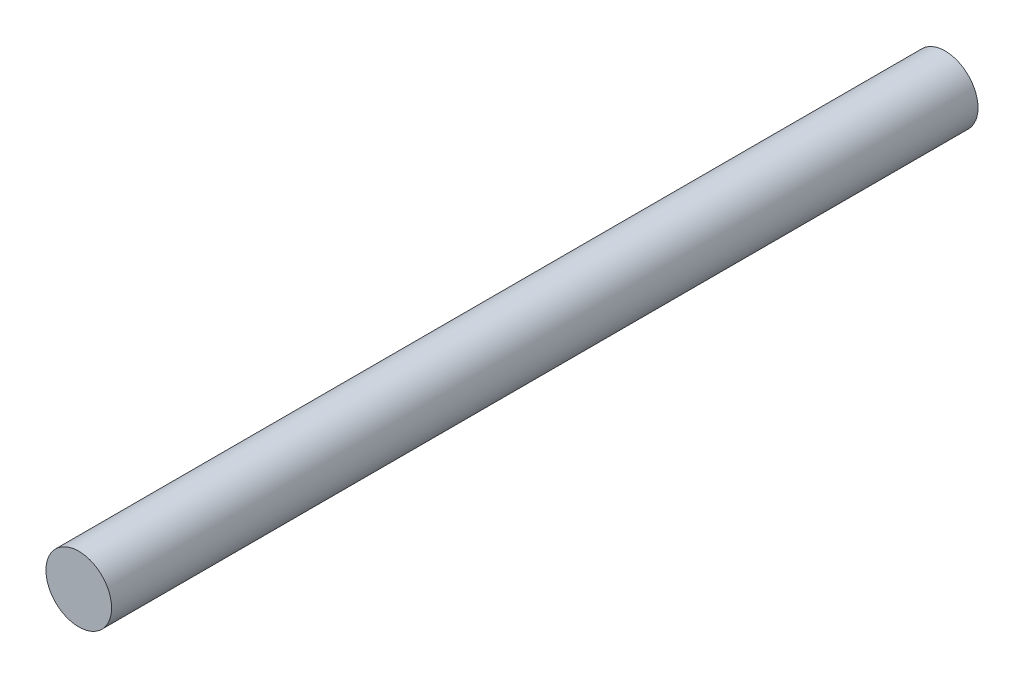
ISO-10303-21;
HEADER;
FILE_DESCRIPTION(('STEP AP214'),'2;1');
FILE_NAME('part.step','',(''),(''),'','','');
FILE_SCHEMA(('AUTOMOTIVE_DESIGN { 1 0 10303 214 1 1 1 1 }'));
ENDSEC;
DATA;
#1=APPLICATION_CONTEXT('core data for automotive mechanical design processes');
#2=APPLICATION_PROTOCOL_DEFINITION('international standard','automotive_design',2000,#1);
#3=PRODUCT_CONTEXT('',#1,'mechanical');
#4=PRODUCT('Part','Part','',(#3));
#5=PRODUCT_RELATED_PRODUCT_CATEGORY('part','',(#4));
#6=PRODUCT_DEFINITION_FORMATION('','',#4);
#7=PRODUCT_DEFINITION_CONTEXT('part definition',#1,'design');
#8=PRODUCT_DEFINITION('design','',#6,#7);
#9=PRODUCT_DEFINITION_SHAPE('','',#8);
#10=(LENGTH_UNIT() NAMED_UNIT(*) SI_UNIT(.MILLI.,.METRE.));
#11=(NAMED_UNIT(*) PLANE_ANGLE_UNIT() SI_UNIT($,.RADIAN.));
#12=(NAMED_UNIT(*) SI_UNIT($,.STERADIAN.) SOLID_ANGLE_UNIT());
#13=UNCERTAINTY_MEASURE_WITH_UNIT(LENGTH_MEASURE(1.E-05),#10,'distance_accuracy_value','');
#14=(GEOMETRIC_REPRESENTATION_CONTEXT(3) GLOBAL_UNCERTAINTY_ASSIGNED_CONTEXT((#13)) GLOBAL_UNIT_ASSIGNED_CONTEXT((#10,
#11,#12)) REPRESENTATION_CONTEXT('',''));
#15=CARTESIAN_POINT('',(0.,0.,0.));
#16=DIRECTION('',(0.,0.,1.));
#17=DIRECTION('',(1.,0.,0.));
#18=AXIS2_PLACEMENT_3D('',#15,#16,#17);
#19=CARTESIAN_POINT('',(0.,0.,66.));
#20=DIRECTION('',(0.,0.,-1.));
#21=DIRECTION('',(-1.,0.,0.));
#22=AXIS2_PLACEMENT_3D('',#19,#20,#21);
#23=CYLINDRICAL_SURFACE('',#22,2.5);
#24=CARTESIAN_POINT('',(0.,0.,66.));
#25=DIRECTION('',(0.,0.,1.));
#26=DIRECTION('',(1.,0.,0.));
#27=AXIS2_PLACEMENT_3D('',#24,#25,#26);
#28=CIRCLE('',#27,2.5);
#29=CARTESIAN_POINT('',(2.5,0.,66.));
#30=VERTEX_POINT('',#29);
#31=EDGE_CURVE('E10',#30,#30,#28,.T.);
#32=ORIENTED_EDGE('',*,*,#31,.F.);
#33=EDGE_LOOP('',(#32));
#34=FACE_BOUND('',#33,.T.);
#35=CARTESIAN_POINT('',(0.,0.,0.));
#36=DIRECTION('',(0.,0.,1.));
#37=DIRECTION('',(1.,0.,0.));
#38=AXIS2_PLACEMENT_3D('',#35,#36,#37);
#39=CIRCLE('',#38,2.5);
#40=CARTESIAN_POINT('',(2.5,0.,0.));
#41=VERTEX_POINT('',#40);
#42=EDGE_CURVE('E35',#41,#41,#39,.T.);
#43=ORIENTED_EDGE('',*,*,#42,.T.);
#44=EDGE_LOOP('',(#43));
#45=FACE_BOUND('',#44,.T.);
#46=ADVANCED_FACE('F32',(#34,#45),#23,.T.);
#47=CARTESIAN_POINT('',(0.,0.,66.));
#48=DIRECTION('',(0.,0.,1.));
#49=DIRECTION('',(1.,0.,0.));
#50=AXIS2_PLACEMENT_3D('',#47,#48,#49);
#51=PLANE('',#50);
#52=ORIENTED_EDGE('',*,*,#31,.T.);
#53=EDGE_LOOP('',(#52));
#54=FACE_BOUND('',#53,.T.);
#55=ADVANCED_FACE('F47',(#54),#51,.T.);
#56=CARTESIAN_POINT('',(0.,0.,0.));
#57=DIRECTION('',(0.,0.,1.));
#58=DIRECTION('',(1.,0.,0.));
#59=AXIS2_PLACEMENT_3D('',#56,#57,#58);
#60=PLANE('',#59);
#61=ORIENTED_EDGE('',*,*,#42,.F.);
#62=EDGE_LOOP('',(#61));
#63=FACE_BOUND('',#62,.T.);
#64=ADVANCED_FACE('F45',(#63),#60,.F.);
#65=CLOSED_SHELL('',(#46,#55,#64));
#66=MANIFOLD_SOLID_BREP('B2',#65);
#67=ADVANCED_BREP_SHAPE_REPRESENTATION('',(#18,#66),#14);
#68=SHAPE_DEFINITION_REPRESENTATION(#9,#67);
ENDSEC;
END-ISO-10303-21;
